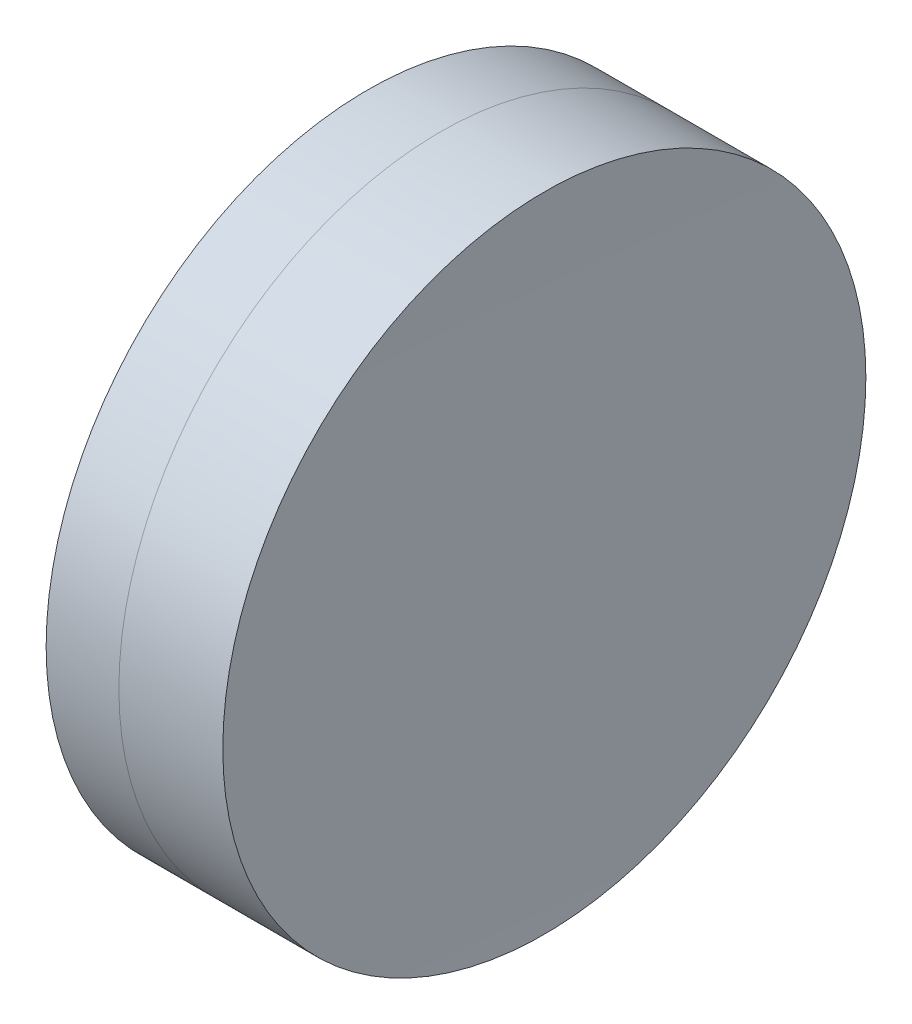
ISO-10303-21;
HEADER;
FILE_DESCRIPTION(('STEP AP214'),'2;1');
FILE_NAME('part.step','',(''),(''),'','','');
FILE_SCHEMA(('AUTOMOTIVE_DESIGN { 1 0 10303 214 1 1 1 1 }'));
ENDSEC;
DATA;
#1=APPLICATION_CONTEXT('core data for automotive mechanical design processes');
#2=APPLICATION_PROTOCOL_DEFINITION('international standard','automotive_design',2000,#1);
#3=PRODUCT_CONTEXT('',#1,'mechanical');
#4=PRODUCT('Part','Part','',(#3));
#5=PRODUCT_RELATED_PRODUCT_CATEGORY('part','',(#4));
#6=PRODUCT_DEFINITION_FORMATION('','',#4);
#7=PRODUCT_DEFINITION_CONTEXT('part definition',#1,'design');
#8=PRODUCT_DEFINITION('design','',#6,#7);
#9=PRODUCT_DEFINITION_SHAPE('','',#8);
#10=(LENGTH_UNIT() NAMED_UNIT(*) SI_UNIT(.MILLI.,.METRE.));
#11=(NAMED_UNIT(*) PLANE_ANGLE_UNIT() SI_UNIT($,.RADIAN.));
#12=(NAMED_UNIT(*) SI_UNIT($,.STERADIAN.) SOLID_ANGLE_UNIT());
#13=UNCERTAINTY_MEASURE_WITH_UNIT(LENGTH_MEASURE(1.E-05),#10,'distance_accuracy_value','');
#14=(GEOMETRIC_REPRESENTATION_CONTEXT(3) GLOBAL_UNCERTAINTY_ASSIGNED_CONTEXT((#13)) GLOBAL_UNIT_ASSIGNED_CONTEXT((#10,
#11,#12)) REPRESENTATION_CONTEXT('',''));
#15=CARTESIAN_POINT('',(0.,0.,0.));
#16=DIRECTION('',(0.,0.,1.));
#17=DIRECTION('',(1.,0.,0.));
#18=AXIS2_PLACEMENT_3D('',#15,#16,#17);
#19=CARTESIAN_POINT('',(260.70895665047,0.,0.));
#20=DIRECTION('',(-1.,0.,0.));
#21=DIRECTION('',(0.,0.,1.));
#22=AXIS2_PLACEMENT_3D('',#19,#20,#21);
#23=SPHERICAL_SURFACE('',#22,40.4);
#24=CARTESIAN_POINT('',(300.606794937776,0.,0.));
#25=DIRECTION('',(-1.,0.,0.));
#26=DIRECTION('',(0.,0.,1.));
#27=AXIS2_PLACEMENT_3D('',#24,#25,#26);
#28=CIRCLE('',#27,6.35);
#29=CARTESIAN_POINT('',(300.606794937776,0.,6.35));
#30=VERTEX_POINT('',#29);
#31=EDGE_CURVE('E11',#30,#30,#28,.T.);
#32=ORIENTED_EDGE('',*,*,#31,.T.);
#33=EDGE_LOOP('',(#32));
#34=FACE_BOUND('',#33,.T.);
#35=ADVANCED_FACE('F45',(#34),#23,.F.);
#36=CARTESIAN_POINT('',(-0.551919992657797,0.,0.));
#37=DIRECTION('',(-1.,0.,0.));
#38=DIRECTION('',(0.,0.,1.));
#39=AXIS2_PLACEMENT_3D('',#36,#37,#38);
#40=CYLINDRICAL_SURFACE('',#39,6.35);
#41=CARTESIAN_POINT('',(302.659603554651,0.,0.));
#42=DIRECTION('',(-1.,0.,0.));
#43=DIRECTION('',(0.,0.,1.));
#44=AXIS2_PLACEMENT_3D('',#41,#42,#43);
#45=CIRCLE('',#44,6.35);
#46=CARTESIAN_POINT('',(302.659603554651,0.,6.35));
#47=VERTEX_POINT('',#46);
#48=EDGE_CURVE('E51',#47,#47,#45,.T.);
#49=ORIENTED_EDGE('',*,*,#48,.T.);
#50=EDGE_LOOP('',(#49));
#51=FACE_BOUND('',#50,.T.);
#52=ORIENTED_EDGE('',*,*,#31,.F.);
#53=EDGE_LOOP('',(#52));
#54=FACE_BOUND('',#53,.T.);
#55=ADVANCED_FACE('F57',(#51,#54),#40,.T.);
#56=CARTESIAN_POINT('',(700.70895665047,0.,0.));
#57=DIRECTION('',(-1.,0.,0.));
#58=DIRECTION('',(0.,0.,-1.));
#59=AXIS2_PLACEMENT_3D('',#56,#57,#58);
#60=SPHERICAL_SURFACE('',#59,398.1);
#61=ORIENTED_EDGE('',*,*,#48,.F.);
#62=EDGE_LOOP('',(#61));
#63=FACE_BOUND('',#62,.T.);
#64=ADVANCED_FACE('F60',(#63),#60,.F.);
#65=CLOSED_SHELL('',(#35,#55,#64));
#66=MANIFOLD_SOLID_BREP('B2',#65);
#67=CARTESIAN_POINT('',(334.80895665047,0.,0.));
#68=DIRECTION('',(-1.,0.,0.));
#69=DIRECTION('',(0.,0.,1.));
#70=AXIS2_PLACEMENT_3D('',#67,#68,#69);
#71=SPHERICAL_SURFACE('',#70,36.2);
#72=CARTESIAN_POINT('',(299.170248761435,0.,0.));
#73=DIRECTION('',(-1.,0.,0.));
#74=DIRECTION('',(0.,0.,1.));
#75=AXIS2_PLACEMENT_3D('',#72,#73,#74);
#76=CIRCLE('',#75,6.35);
#77=CARTESIAN_POINT('',(299.170248761435,0.,6.35));
#78=VERTEX_POINT('',#77);
#79=EDGE_CURVE('E44',#78,#78,#76,.T.);
#80=ORIENTED_EDGE('',*,*,#79,.T.);
#81=EDGE_LOOP('',(#80));
#82=FACE_BOUND('',#81,.T.);
#83=ADVANCED_FACE('F86',(#82),#71,.T.);
#84=CARTESIAN_POINT('',(124.523309526045,0.,0.));
#85=DIRECTION('',(-1.,0.,0.));
#86=DIRECTION('',(0.,0.,1.));
#87=AXIS2_PLACEMENT_3D('',#84,#85,#86);
#88=CYLINDRICAL_SURFACE('',#87,6.35);
#89=CARTESIAN_POINT('',(300.606794937776,0.,0.));
#90=DIRECTION('',(-1.,0.,0.));
#91=DIRECTION('',(0.,0.,1.));
#92=AXIS2_PLACEMENT_3D('',#89,#90,#91);
#93=CIRCLE('',#92,6.35);
#94=CARTESIAN_POINT('',(300.606794937776,0.,6.35));
#95=VERTEX_POINT('',#94);
#96=EDGE_CURVE('E92',#95,#95,#93,.T.);
#97=ORIENTED_EDGE('',*,*,#96,.T.);
#98=EDGE_LOOP('',(#97));
#99=FACE_BOUND('',#98,.T.);
#100=ORIENTED_EDGE('',*,*,#79,.F.);
#101=EDGE_LOOP('',(#100));
#102=FACE_BOUND('',#101,.T.);
#103=ADVANCED_FACE('F98',(#99,#102),#88,.T.);
#104=CARTESIAN_POINT('',(260.70895665047,0.,0.));
#105=DIRECTION('',(-1.,0.,0.));
#106=DIRECTION('',(0.,0.,1.));
#107=AXIS2_PLACEMENT_3D('',#104,#105,#106);
#108=SPHERICAL_SURFACE('',#107,40.4);
#109=ORIENTED_EDGE('',*,*,#96,.F.);
#110=EDGE_LOOP('',(#109));
#111=FACE_BOUND('',#110,.T.);
#112=ADVANCED_FACE('F101',(#111),#108,.T.);
#113=CLOSED_SHELL('',(#83,#103,#112));
#114=MANIFOLD_SOLID_BREP('B6',#113);
#115=ADVANCED_BREP_SHAPE_REPRESENTATION('',(#18,#66,#114),#14);
#116=SHAPE_DEFINITION_REPRESENTATION(#9,#115);
ENDSEC;
END-ISO-10303-21;
